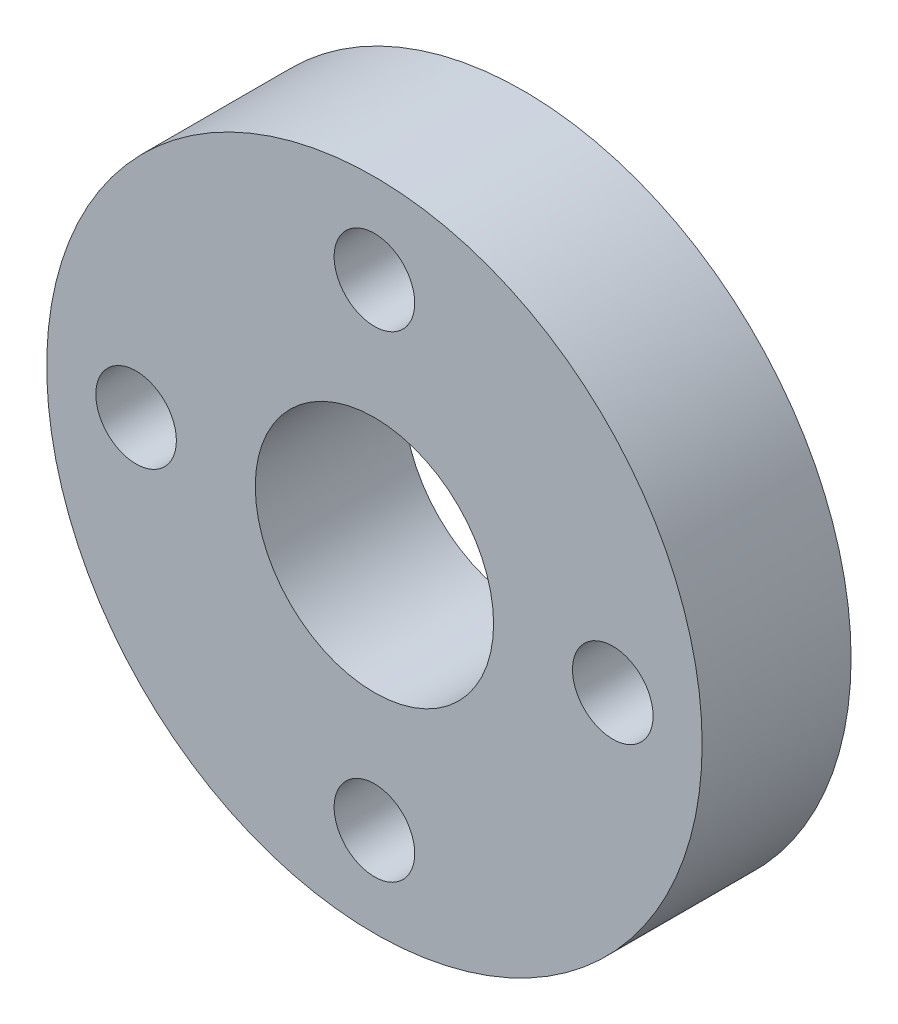
ISO-10303-21;
HEADER;
FILE_DESCRIPTION(('STEP AP214'),'2;1');
FILE_NAME('part.step','',(''),(''),'','','');
FILE_SCHEMA(('AUTOMOTIVE_DESIGN { 1 0 10303 214 1 1 1 1 }'));
ENDSEC;
DATA;
#1=APPLICATION_CONTEXT('core data for automotive mechanical design processes');
#2=APPLICATION_PROTOCOL_DEFINITION('international standard','automotive_design',2000,#1);
#3=PRODUCT_CONTEXT('',#1,'mechanical');
#4=PRODUCT('Part','Part','',(#3));
#5=PRODUCT_RELATED_PRODUCT_CATEGORY('part','',(#4));
#6=PRODUCT_DEFINITION_FORMATION('','',#4);
#7=PRODUCT_DEFINITION_CONTEXT('part definition',#1,'design');
#8=PRODUCT_DEFINITION('design','',#6,#7);
#9=PRODUCT_DEFINITION_SHAPE('','',#8);
#10=(LENGTH_UNIT() NAMED_UNIT(*) SI_UNIT(.MILLI.,.METRE.));
#11=(NAMED_UNIT(*) PLANE_ANGLE_UNIT() SI_UNIT($,.RADIAN.));
#12=(NAMED_UNIT(*) SI_UNIT($,.STERADIAN.) SOLID_ANGLE_UNIT());
#13=UNCERTAINTY_MEASURE_WITH_UNIT(LENGTH_MEASURE(1.E-05),#10,'distance_accuracy_value','');
#14=(GEOMETRIC_REPRESENTATION_CONTEXT(3) GLOBAL_UNCERTAINTY_ASSIGNED_CONTEXT((#13)) GLOBAL_UNIT_ASSIGNED_CONTEXT((#10,
#11,#12)) REPRESENTATION_CONTEXT('',''));
#15=CARTESIAN_POINT('',(0.,0.,0.));
#16=DIRECTION('',(0.,0.,1.));
#17=DIRECTION('',(1.,0.,0.));
#18=AXIS2_PLACEMENT_3D('',#15,#16,#17);
#19=CARTESIAN_POINT('',(0.,0.,2.5));
#20=DIRECTION('',(0.,0.,1.));
#21=DIRECTION('',(1.,0.,0.));
#22=AXIS2_PLACEMENT_3D('',#19,#20,#21);
#23=PLANE('',#22);
#24=CARTESIAN_POINT('',(-8.,0.,2.5));
#25=DIRECTION('',(0.,0.,1.));
#26=DIRECTION('',(1.,0.,0.));
#27=AXIS2_PLACEMENT_3D('',#24,#25,#26);
#28=CIRCLE('',#27,1.35255);
#29=CARTESIAN_POINT('',(-6.64745,0.,2.5));
#30=VERTEX_POINT('',#29);
#31=EDGE_CURVE('E62',#30,#30,#28,.T.);
#32=ORIENTED_EDGE('',*,*,#31,.F.);
#33=EDGE_LOOP('',(#32));
#34=FACE_BOUND('',#33,.T.);
#35=CARTESIAN_POINT('',(0.,-8.,2.5));
#36=DIRECTION('',(0.,0.,1.));
#37=DIRECTION('',(1.,0.,0.));
#38=AXIS2_PLACEMENT_3D('',#35,#36,#37);
#39=CIRCLE('',#38,1.35255);
#40=CARTESIAN_POINT('',(1.35255,-8.,2.5));
#41=VERTEX_POINT('',#40);
#42=EDGE_CURVE('E54',#41,#41,#39,.T.);
#43=ORIENTED_EDGE('',*,*,#42,.F.);
#44=EDGE_LOOP('',(#43));
#45=FACE_BOUND('',#44,.T.);
#46=CARTESIAN_POINT('',(8.,0.,2.5));
#47=DIRECTION('',(0.,0.,1.));
#48=DIRECTION('',(1.,0.,0.));
#49=AXIS2_PLACEMENT_3D('',#46,#47,#48);
#50=CIRCLE('',#49,1.35255);
#51=CARTESIAN_POINT('',(9.35255,0.,2.5));
#52=VERTEX_POINT('',#51);
#53=EDGE_CURVE('E46',#52,#52,#50,.T.);
#54=ORIENTED_EDGE('',*,*,#53,.F.);
#55=EDGE_LOOP('',(#54));
#56=FACE_BOUND('',#55,.T.);
#57=CARTESIAN_POINT('',(0.,8.,2.5));
#58=DIRECTION('',(0.,0.,1.));
#59=DIRECTION('',(1.,0.,0.));
#60=AXIS2_PLACEMENT_3D('',#57,#58,#59);
#61=CIRCLE('',#60,1.35255);
#62=CARTESIAN_POINT('',(1.35255,8.,2.5));
#63=VERTEX_POINT('',#62);
#64=EDGE_CURVE('E38',#63,#63,#61,.T.);
#65=ORIENTED_EDGE('',*,*,#64,.F.);
#66=EDGE_LOOP('',(#65));
#67=FACE_BOUND('',#66,.T.);
#68=CARTESIAN_POINT('',(0.,0.,2.5));
#69=DIRECTION('',(0.,0.,1.));
#70=DIRECTION('',(1.,0.,0.));
#71=AXIS2_PLACEMENT_3D('',#68,#69,#70);
#72=CIRCLE('',#71,11.);
#73=CARTESIAN_POINT('',(11.,0.,2.5));
#74=VERTEX_POINT('',#73);
#75=EDGE_CURVE('E9',#74,#74,#72,.T.);
#76=ORIENTED_EDGE('',*,*,#75,.T.);
#77=EDGE_LOOP('',(#76));
#78=FACE_BOUND('',#77,.T.);
#79=CARTESIAN_POINT('',(0.,0.,2.5));
#80=DIRECTION('',(0.,0.,1.));
#81=DIRECTION('',(1.,0.,0.));
#82=AXIS2_PLACEMENT_3D('',#79,#80,#81);
#83=CIRCLE('',#82,4.);
#84=CARTESIAN_POINT('',(4.,0.,2.5));
#85=VERTEX_POINT('',#84);
#86=EDGE_CURVE('E34',#85,#85,#83,.T.);
#87=ORIENTED_EDGE('',*,*,#86,.F.);
#88=EDGE_LOOP('',(#87));
#89=FACE_BOUND('',#88,.T.);
#90=ADVANCED_FACE('F14',(#34,#45,#56,#67,#78,#89),#23,.T.);
#91=CARTESIAN_POINT('',(0.,0.,-2.5));
#92=DIRECTION('',(0.,0.,1.));
#93=DIRECTION('',(1.,0.,0.));
#94=AXIS2_PLACEMENT_3D('',#91,#92,#93);
#95=PLANE('',#94);
#96=CARTESIAN_POINT('',(-8.,0.,-2.5));
#97=DIRECTION('',(0.,0.,1.));
#98=DIRECTION('',(1.,0.,0.));
#99=AXIS2_PLACEMENT_3D('',#96,#97,#98);
#100=CIRCLE('',#99,1.35255);
#101=CARTESIAN_POINT('',(-6.64745,0.,-2.5));
#102=VERTEX_POINT('',#101);
#103=EDGE_CURVE('E66',#102,#102,#100,.T.);
#104=ORIENTED_EDGE('',*,*,#103,.T.);
#105=EDGE_LOOP('',(#104));
#106=FACE_BOUND('',#105,.T.);
#107=CARTESIAN_POINT('',(0.,-8.,-2.5));
#108=DIRECTION('',(0.,0.,1.));
#109=DIRECTION('',(1.,0.,0.));
#110=AXIS2_PLACEMENT_3D('',#107,#108,#109);
#111=CIRCLE('',#110,1.35255);
#112=CARTESIAN_POINT('',(1.35255,-8.,-2.5));
#113=VERTEX_POINT('',#112);
#114=EDGE_CURVE('E58',#113,#113,#111,.T.);
#115=ORIENTED_EDGE('',*,*,#114,.T.);
#116=EDGE_LOOP('',(#115));
#117=FACE_BOUND('',#116,.T.);
#118=CARTESIAN_POINT('',(8.,0.,-2.5));
#119=DIRECTION('',(0.,0.,1.));
#120=DIRECTION('',(1.,0.,0.));
#121=AXIS2_PLACEMENT_3D('',#118,#119,#120);
#122=CIRCLE('',#121,1.35255);
#123=CARTESIAN_POINT('',(9.35255,0.,-2.5));
#124=VERTEX_POINT('',#123);
#125=EDGE_CURVE('E50',#124,#124,#122,.T.);
#126=ORIENTED_EDGE('',*,*,#125,.T.);
#127=EDGE_LOOP('',(#126));
#128=FACE_BOUND('',#127,.T.);
#129=CARTESIAN_POINT('',(0.,8.,-2.5));
#130=DIRECTION('',(0.,0.,1.));
#131=DIRECTION('',(1.,0.,0.));
#132=AXIS2_PLACEMENT_3D('',#129,#130,#131);
#133=CIRCLE('',#132,1.35255);
#134=CARTESIAN_POINT('',(1.35255,8.,-2.5));
#135=VERTEX_POINT('',#134);
#136=EDGE_CURVE('E42',#135,#135,#133,.T.);
#137=ORIENTED_EDGE('',*,*,#136,.T.);
#138=EDGE_LOOP('',(#137));
#139=FACE_BOUND('',#138,.T.);
#140=CARTESIAN_POINT('',(0.,0.,-2.5));
#141=DIRECTION('',(0.,0.,1.));
#142=DIRECTION('',(1.,0.,0.));
#143=AXIS2_PLACEMENT_3D('',#140,#141,#142);
#144=CIRCLE('',#143,11.);
#145=CARTESIAN_POINT('',(11.,0.,-2.5));
#146=VERTEX_POINT('',#145);
#147=EDGE_CURVE('E18',#146,#146,#144,.T.);
#148=ORIENTED_EDGE('',*,*,#147,.F.);
#149=EDGE_LOOP('',(#148));
#150=FACE_BOUND('',#149,.T.);
#151=CARTESIAN_POINT('',(0.,0.,-2.5));
#152=DIRECTION('',(0.,0.,1.));
#153=DIRECTION('',(1.,0.,0.));
#154=AXIS2_PLACEMENT_3D('',#151,#152,#153);
#155=CIRCLE('',#154,4.);
#156=CARTESIAN_POINT('',(4.,0.,-2.5));
#157=VERTEX_POINT('',#156);
#158=EDGE_CURVE('E29',#157,#157,#155,.T.);
#159=ORIENTED_EDGE('',*,*,#158,.T.);
#160=EDGE_LOOP('',(#159));
#161=FACE_BOUND('',#160,.T.);
#162=ADVANCED_FACE('F75',(#106,#117,#128,#139,#150,#161),#95,.F.);
#163=CARTESIAN_POINT('',(0.,0.,2.5));
#164=DIRECTION('',(0.,0.,-1.));
#165=DIRECTION('',(-1.,0.,0.));
#166=AXIS2_PLACEMENT_3D('',#163,#164,#165);
#167=CYLINDRICAL_SURFACE('',#166,11.);
#168=ORIENTED_EDGE('',*,*,#75,.F.);
#169=EDGE_LOOP('',(#168));
#170=FACE_BOUND('',#169,.T.);
#171=ORIENTED_EDGE('',*,*,#147,.T.);
#172=EDGE_LOOP('',(#171));
#173=FACE_BOUND('',#172,.T.);
#174=ADVANCED_FACE('F16',(#170,#173),#167,.T.);
#175=CARTESIAN_POINT('',(0.,0.,2.5));
#176=DIRECTION('',(0.,0.,-1.));
#177=DIRECTION('',(-1.,0.,0.));
#178=AXIS2_PLACEMENT_3D('',#175,#176,#177);
#179=CYLINDRICAL_SURFACE('',#178,4.);
#180=ORIENTED_EDGE('',*,*,#86,.T.);
#181=EDGE_LOOP('',(#180));
#182=FACE_BOUND('',#181,.T.);
#183=ORIENTED_EDGE('',*,*,#158,.F.);
#184=EDGE_LOOP('',(#183));
#185=FACE_BOUND('',#184,.T.);
#186=ADVANCED_FACE('F96',(#182,#185),#179,.F.);
#187=CARTESIAN_POINT('',(0.,8.,2.5));
#188=DIRECTION('',(0.,0.,1.));
#189=DIRECTION('',(1.,0.,0.));
#190=AXIS2_PLACEMENT_3D('',#187,#188,#189);
#191=CYLINDRICAL_SURFACE('',#190,1.35255);
#192=ORIENTED_EDGE('',*,*,#136,.F.);
#193=EDGE_LOOP('',(#192));
#194=FACE_BOUND('',#193,.T.);
#195=ORIENTED_EDGE('',*,*,#64,.T.);
#196=EDGE_LOOP('',(#195));
#197=FACE_BOUND('',#196,.T.);
#198=ADVANCED_FACE('F99',(#194,#197),#191,.F.);
#199=CARTESIAN_POINT('',(8.,0.,2.5));
#200=DIRECTION('',(0.,0.,1.));
#201=DIRECTION('',(1.,0.,0.));
#202=AXIS2_PLACEMENT_3D('',#199,#200,#201);
#203=CYLINDRICAL_SURFACE('',#202,1.35255);
#204=ORIENTED_EDGE('',*,*,#125,.F.);
#205=EDGE_LOOP('',(#204));
#206=FACE_BOUND('',#205,.T.);
#207=ORIENTED_EDGE('',*,*,#53,.T.);
#208=EDGE_LOOP('',(#207));
#209=FACE_BOUND('',#208,.T.);
#210=ADVANCED_FACE('F112',(#206,#209),#203,.F.);
#211=CARTESIAN_POINT('',(0.,-8.,2.5));
#212=DIRECTION('',(0.,0.,1.));
#213=DIRECTION('',(1.,0.,0.));
#214=AXIS2_PLACEMENT_3D('',#211,#212,#213);
#215=CYLINDRICAL_SURFACE('',#214,1.35255);
#216=ORIENTED_EDGE('',*,*,#114,.F.);
#217=EDGE_LOOP('',(#216));
#218=FACE_BOUND('',#217,.T.);
#219=ORIENTED_EDGE('',*,*,#42,.T.);
#220=EDGE_LOOP('',(#219));
#221=FACE_BOUND('',#220,.T.);
#222=ADVANCED_FACE('F81',(#218,#221),#215,.F.);
#223=CARTESIAN_POINT('',(-8.,0.,2.5));
#224=DIRECTION('',(0.,0.,1.));
#225=DIRECTION('',(1.,0.,0.));
#226=AXIS2_PLACEMENT_3D('',#223,#224,#225);
#227=CYLINDRICAL_SURFACE('',#226,1.35255);
#228=ORIENTED_EDGE('',*,*,#103,.F.);
#229=EDGE_LOOP('',(#228));
#230=FACE_BOUND('',#229,.T.);
#231=ORIENTED_EDGE('',*,*,#31,.T.);
#232=EDGE_LOOP('',(#231));
#233=FACE_BOUND('',#232,.T.);
#234=ADVANCED_FACE('F78',(#230,#233),#227,.F.);
#235=CLOSED_SHELL('',(#90,#162,#174,#186,#198,#210,#222,#234));
#236=MANIFOLD_SOLID_BREP('B1',#235);
#237=ADVANCED_BREP_SHAPE_REPRESENTATION('',(#18,#236),#14);
#238=SHAPE_DEFINITION_REPRESENTATION(#9,#237);
ENDSEC;
END-ISO-10303-21;
